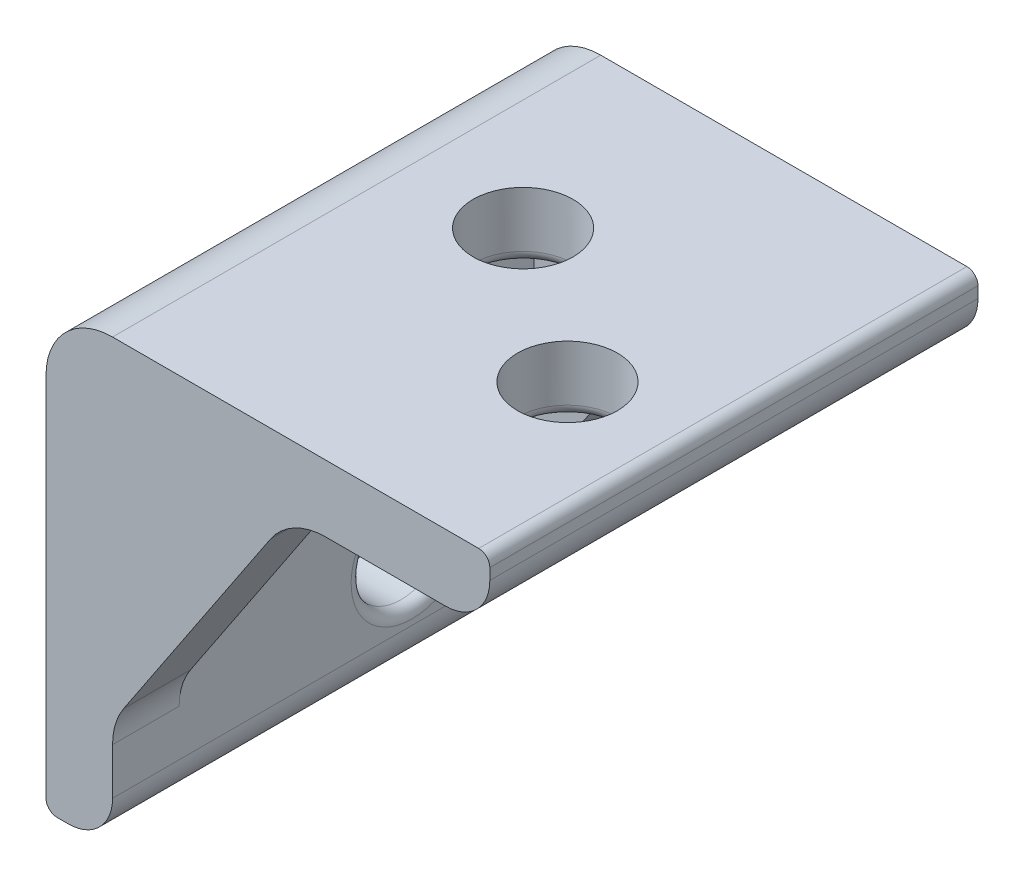
ISO-10303-21;
HEADER;
FILE_DESCRIPTION(('STEP AP214'),'2;1');
FILE_NAME('part.step','',(''),(''),'','','');
FILE_SCHEMA(('AUTOMOTIVE_DESIGN { 1 0 10303 214 1 1 1 1 }'));
ENDSEC;
DATA;
#1=APPLICATION_CONTEXT('core data for automotive mechanical design processes');
#2=APPLICATION_PROTOCOL_DEFINITION('international standard','automotive_design',2000,#1);
#3=PRODUCT_CONTEXT('',#1,'mechanical');
#4=PRODUCT('Part','Part','',(#3));
#5=PRODUCT_RELATED_PRODUCT_CATEGORY('part','',(#4));
#6=PRODUCT_DEFINITION_FORMATION('','',#4);
#7=PRODUCT_DEFINITION_CONTEXT('part definition',#1,'design');
#8=PRODUCT_DEFINITION('design','',#6,#7);
#9=PRODUCT_DEFINITION_SHAPE('','',#8);
#10=(LENGTH_UNIT() NAMED_UNIT(*) SI_UNIT(.MILLI.,.METRE.));
#11=(NAMED_UNIT(*) PLANE_ANGLE_UNIT() SI_UNIT($,.RADIAN.));
#12=(NAMED_UNIT(*) SI_UNIT($,.STERADIAN.) SOLID_ANGLE_UNIT());
#13=UNCERTAINTY_MEASURE_WITH_UNIT(LENGTH_MEASURE(1.E-05),#10,'distance_accuracy_value','');
#14=(GEOMETRIC_REPRESENTATION_CONTEXT(3) GLOBAL_UNCERTAINTY_ASSIGNED_CONTEXT((#13)) GLOBAL_UNIT_ASSIGNED_CONTEXT((#10,
#11,#12)) REPRESENTATION_CONTEXT('',''));
#15=CARTESIAN_POINT('',(0.,0.,0.));
#16=DIRECTION('',(0.,0.,1.));
#17=DIRECTION('',(1.,0.,0.));
#18=AXIS2_PLACEMENT_3D('',#15,#16,#17);
#19=CARTESIAN_POINT('',(-19.5,-16.5,11.));
#20=DIRECTION('',(0.,0.,-1.));
#21=DIRECTION('',(-1.,0.,0.));
#22=AXIS2_PLACEMENT_3D('',#19,#20,#21);
#23=CYLINDRICAL_SURFACE('',#22,0.500000000000002);
#24=CARTESIAN_POINT('',(-19.5,-16.5,-11.));
#25=DIRECTION('',(0.,0.,1.));
#26=DIRECTION('',(1.,0.,0.));
#27=AXIS2_PLACEMENT_3D('',#24,#25,#26);
#28=CIRCLE('',#27,0.500000000000002);
#29=CARTESIAN_POINT('',(-20.,-16.5,-11.));
#30=VERTEX_POINT('',#29);
#31=CARTESIAN_POINT('',(-19.5,-17.,-11.));
#32=VERTEX_POINT('',#31);
#33=EDGE_CURVE('E219',#30,#32,#28,.T.);
#34=ORIENTED_EDGE('',*,*,#33,.T.);
#35=DIRECTION('',(0.,0.,-1.));
#36=VECTOR('',#35,1.);
#37=CARTESIAN_POINT('',(-19.5,-17.,11.));
#38=LINE('',#37,#36);
#39=CARTESIAN_POINT('',(-19.5,-17.,11.));
#40=VERTEX_POINT('',#39);
#41=EDGE_CURVE('E208',#40,#32,#38,.T.);
#42=ORIENTED_EDGE('',*,*,#41,.F.);
#43=CARTESIAN_POINT('',(-19.5,-16.5,11.));
#44=DIRECTION('',(0.,0.,1.));
#45=DIRECTION('',(1.,0.,0.));
#46=AXIS2_PLACEMENT_3D('',#43,#44,#45);
#47=CIRCLE('',#46,0.500000000000002);
#48=CARTESIAN_POINT('',(-20.,-16.5,11.));
#49=VERTEX_POINT('',#48);
#50=EDGE_CURVE('E317',#49,#40,#47,.T.);
#51=ORIENTED_EDGE('',*,*,#50,.F.);
#52=DIRECTION('',(0.,0.,-1.));
#53=VECTOR('',#52,1.);
#54=CARTESIAN_POINT('',(-20.,-16.5,11.));
#55=LINE('',#54,#53);
#56=EDGE_CURVE('E318',#49,#30,#55,.T.);
#57=ORIENTED_EDGE('',*,*,#56,.T.);
#58=EDGE_LOOP('',(#34,#42,#51,#57));
#59=FACE_BOUND('',#58,.T.);
#60=ADVANCED_FACE('F38',(#59),#23,.T.);
#61=CARTESIAN_POINT('',(-19.,-17.,11.));
#62=DIRECTION('',(0.,1.,0.));
#63=DIRECTION('',(-1.,0.,0.));
#64=AXIS2_PLACEMENT_3D('',#61,#62,#63);
#65=PLANE('',#64);
#66=DIRECTION('',(1.,0.,0.));
#67=VECTOR('',#66,1.);
#68=CARTESIAN_POINT('',(-19.,-17.,-11.));
#69=LINE('',#68,#67);
#70=CARTESIAN_POINT('',(-19.,-17.,-11.));
#71=VERTEX_POINT('',#70);
#72=EDGE_CURVE('E359',#32,#71,#69,.T.);
#73=ORIENTED_EDGE('',*,*,#72,.T.);
#74=DIRECTION('',(0.,0.,-1.));
#75=VECTOR('',#74,1.);
#76=CARTESIAN_POINT('',(-19.,-17.,11.));
#77=LINE('',#76,#75);
#78=CARTESIAN_POINT('',(-19.,-17.,11.));
#79=VERTEX_POINT('',#78);
#80=EDGE_CURVE('E199',#79,#71,#77,.T.);
#81=ORIENTED_EDGE('',*,*,#80,.F.);
#82=DIRECTION('',(1.,0.,0.));
#83=VECTOR('',#82,1.);
#84=CARTESIAN_POINT('',(-19.,-17.,11.));
#85=LINE('',#84,#83);
#86=EDGE_CURVE('E382',#40,#79,#85,.T.);
#87=ORIENTED_EDGE('',*,*,#86,.F.);
#88=ORIENTED_EDGE('',*,*,#41,.T.);
#89=EDGE_LOOP('',(#73,#81,#87,#88));
#90=FACE_BOUND('',#89,.T.);
#91=ADVANCED_FACE('F410',(#90),#65,.F.);
#92=CARTESIAN_POINT('',(-19.,-15.,11.));
#93=DIRECTION('',(0.,0.,-1.));
#94=DIRECTION('',(-1.,0.,0.));
#95=AXIS2_PLACEMENT_3D('',#92,#93,#94);
#96=CYLINDRICAL_SURFACE('',#95,2.);
#97=CARTESIAN_POINT('',(-19.,-15.,-11.));
#98=DIRECTION('',(0.,0.,1.));
#99=DIRECTION('',(-1.,0.,0.));
#100=AXIS2_PLACEMENT_3D('',#97,#98,#99);
#101=CIRCLE('',#100,2.);
#102=CARTESIAN_POINT('',(-17.,-15.,-11.));
#103=VERTEX_POINT('',#102);
#104=EDGE_CURVE('E305',#71,#103,#101,.T.);
#105=ORIENTED_EDGE('',*,*,#104,.T.);
#106=DIRECTION('',(0.,0.,-1.));
#107=VECTOR('',#106,1.);
#108=CARTESIAN_POINT('',(-17.,-15.,11.));
#109=LINE('',#108,#107);
#110=CARTESIAN_POINT('',(-17.,-15.,11.));
#111=VERTEX_POINT('',#110);
#112=EDGE_CURVE('E195',#111,#103,#109,.T.);
#113=ORIENTED_EDGE('',*,*,#112,.F.);
#114=CARTESIAN_POINT('',(-19.,-15.,11.));
#115=DIRECTION('',(0.,0.,1.));
#116=DIRECTION('',(-1.,0.,0.));
#117=AXIS2_PLACEMENT_3D('',#114,#115,#116);
#118=CIRCLE('',#117,2.);
#119=EDGE_CURVE('E384',#79,#111,#118,.T.);
#120=ORIENTED_EDGE('',*,*,#119,.F.);
#121=ORIENTED_EDGE('',*,*,#80,.T.);
#122=EDGE_LOOP('',(#105,#113,#120,#121));
#123=FACE_BOUND('',#122,.T.);
#124=ADVANCED_FACE('F363',(#123),#96,.T.);
#125=CARTESIAN_POINT('',(-17.,0.,11.));
#126=DIRECTION('',(-1.,0.,0.));
#127=DIRECTION('',(0.,-1.,0.));
#128=AXIS2_PLACEMENT_3D('',#125,#126,#127);
#129=PLANE('',#128);
#130=CARTESIAN_POINT('',(-17.,-5.,2.5));
#131=DIRECTION('',(-1.,0.,0.));
#132=DIRECTION('',(0.,-1.,0.));
#133=AXIS2_PLACEMENT_3D('',#130,#131,#132);
#134=CIRCLE('',#133,2.75);
#135=CARTESIAN_POINT('',(-17.,-7.75,2.5));
#136=VERTEX_POINT('',#135);
#137=EDGE_CURVE('E239',#136,#136,#134,.T.);
#138=ORIENTED_EDGE('',*,*,#137,.T.);
#139=EDGE_LOOP('',(#138));
#140=FACE_BOUND('',#139,.T.);
#141=CARTESIAN_POINT('',(-17.,-12.,-2.5));
#142=DIRECTION('',(-1.,0.,0.));
#143=DIRECTION('',(0.,-1.,0.));
#144=AXIS2_PLACEMENT_3D('',#141,#142,#143);
#145=CIRCLE('',#144,2.75);
#146=CARTESIAN_POINT('',(-17.,-14.75,-2.5));
#147=VERTEX_POINT('',#146);
#148=EDGE_CURVE('E236',#147,#147,#145,.T.);
#149=ORIENTED_EDGE('',*,*,#148,.T.);
#150=EDGE_LOOP('',(#149));
#151=FACE_BOUND('',#150,.T.);
#152=DIRECTION('',(0.,-1.,0.));
#153=VECTOR('',#152,1.);
#154=CARTESIAN_POINT('',(-17.,0.,8.));
#155=LINE('',#154,#153);
#156=CARTESIAN_POINT('',(-17.,0.,8.));
#157=VERTEX_POINT('',#156);
#158=CARTESIAN_POINT('',(-17.,-12.908326913196,8.));
#159=VERTEX_POINT('',#158);
#160=EDGE_CURVE('E167',#157,#159,#155,.T.);
#161=ORIENTED_EDGE('',*,*,#160,.T.);
#162=DIRECTION('',(0.,0.,1.));
#163=VECTOR('',#162,1.);
#164=CARTESIAN_POINT('',(-17.,-12.908326913196,11.));
#165=LINE('',#164,#163);
#166=CARTESIAN_POINT('',(-17.,-12.908326913196,11.));
#167=VERTEX_POINT('',#166);
#168=EDGE_CURVE('E259',#159,#167,#165,.T.);
#169=ORIENTED_EDGE('',*,*,#168,.T.);
#170=DIRECTION('',(0.,1.,0.));
#171=VECTOR('',#170,1.);
#172=CARTESIAN_POINT('',(-17.,0.,11.));
#173=LINE('',#172,#171);
#174=EDGE_CURVE('E370',#111,#167,#173,.T.);
#175=ORIENTED_EDGE('',*,*,#174,.F.);
#176=ORIENTED_EDGE('',*,*,#112,.T.);
#177=DIRECTION('',(0.,1.,0.));
#178=VECTOR('',#177,1.);
#179=CARTESIAN_POINT('',(-17.,0.,-11.));
#180=LINE('',#179,#178);
#181=CARTESIAN_POINT('',(-17.,-12.908326913196,-11.));
#182=VERTEX_POINT('',#181);
#183=EDGE_CURVE('E300',#103,#182,#180,.T.);
#184=ORIENTED_EDGE('',*,*,#183,.T.);
#185=DIRECTION('',(0.,0.,-1.));
#186=VECTOR('',#185,1.);
#187=CARTESIAN_POINT('',(-17.,-12.908326913196,11.));
#188=LINE('',#187,#186);
#189=CARTESIAN_POINT('',(-17.,-12.908326913196,-8.));
#190=VERTEX_POINT('',#189);
#191=EDGE_CURVE('E257',#182,#190,#188,.F.);
#192=ORIENTED_EDGE('',*,*,#191,.T.);
#193=DIRECTION('',(0.,1.,0.));
#194=VECTOR('',#193,1.);
#195=CARTESIAN_POINT('',(-17.,0.,-8.));
#196=LINE('',#195,#194);
#197=CARTESIAN_POINT('',(-17.,0.,-8.));
#198=VERTEX_POINT('',#197);
#199=EDGE_CURVE('E193',#190,#198,#196,.T.);
#200=ORIENTED_EDGE('',*,*,#199,.T.);
#201=DIRECTION('',(0.,0.,-1.));
#202=VECTOR('',#201,1.);
#203=CARTESIAN_POINT('',(-17.,0.,11.));
#204=LINE('',#203,#202);
#205=EDGE_CURVE('E185',#157,#198,#204,.T.);
#206=ORIENTED_EDGE('',*,*,#205,.F.);
#207=EDGE_LOOP('',(#161,#169,#175,#176,#184,#192,#200,#206));
#208=FACE_BOUND('',#207,.T.);
#209=ADVANCED_FACE('F191',(#140,#151,#208),#129,.F.);
#210=CARTESIAN_POINT('',(-17.,0.,11.));
#211=DIRECTION('',(0.,1.,0.));
#212=DIRECTION('',(-1.,0.,0.));
#213=AXIS2_PLACEMENT_3D('',#210,#211,#212);
#214=PLANE('',#213);
#215=CARTESIAN_POINT('',(-12.,0.,-2.5));
#216=DIRECTION('',(0.,1.,0.));
#217=DIRECTION('',(-1.,0.,0.));
#218=AXIS2_PLACEMENT_3D('',#215,#216,#217);
#219=CIRCLE('',#218,2.75);
#220=CARTESIAN_POINT('',(-14.75,0.,-2.5));
#221=VERTEX_POINT('',#220);
#222=EDGE_CURVE('E227',#221,#221,#219,.T.);
#223=ORIENTED_EDGE('',*,*,#222,.T.);
#224=EDGE_LOOP('',(#223));
#225=FACE_BOUND('',#224,.T.);
#226=CARTESIAN_POINT('',(-5.,0.,2.5));
#227=DIRECTION('',(0.,1.,0.));
#228=DIRECTION('',(-1.,0.,0.));
#229=AXIS2_PLACEMENT_3D('',#226,#227,#228);
#230=CIRCLE('',#229,2.75);
#231=CARTESIAN_POINT('',(-7.75,0.,2.5));
#232=VERTEX_POINT('',#231);
#233=EDGE_CURVE('E211',#232,#232,#230,.T.);
#234=ORIENTED_EDGE('',*,*,#233,.T.);
#235=EDGE_LOOP('',(#234));
#236=FACE_BOUND('',#235,.T.);
#237=DIRECTION('',(1.,0.,0.));
#238=VECTOR('',#237,1.);
#239=CARTESIAN_POINT('',(-17.,0.,11.));
#240=LINE('',#239,#238);
#241=CARTESIAN_POINT('',(-7.39444872453601,0.,11.));
#242=VERTEX_POINT('',#241);
#243=CARTESIAN_POINT('',(-2.00000000000001,0.,11.));
#244=VERTEX_POINT('',#243);
#245=EDGE_CURVE('E387',#242,#244,#240,.T.);
#246=ORIENTED_EDGE('',*,*,#245,.F.);
#247=DIRECTION('',(0.,0.,-1.));
#248=VECTOR('',#247,1.);
#249=CARTESIAN_POINT('',(-7.39444872453601,0.,11.));
#250=LINE('',#249,#248);
#251=CARTESIAN_POINT('',(-7.39444872453601,0.,8.));
#252=VERTEX_POINT('',#251);
#253=EDGE_CURVE('E188',#242,#252,#250,.T.);
#254=ORIENTED_EDGE('',*,*,#253,.T.);
#255=DIRECTION('',(-1.,0.,0.));
#256=VECTOR('',#255,1.);
#257=CARTESIAN_POINT('',(-17.,0.,8.));
#258=LINE('',#257,#256);
#259=EDGE_CURVE('E170',#252,#157,#258,.T.);
#260=ORIENTED_EDGE('',*,*,#259,.T.);
#261=ORIENTED_EDGE('',*,*,#205,.T.);
#262=DIRECTION('',(1.,0.,0.));
#263=VECTOR('',#262,1.);
#264=CARTESIAN_POINT('',(-17.,0.,-8.));
#265=LINE('',#264,#263);
#266=CARTESIAN_POINT('',(-7.39444872453601,0.,-8.));
#267=VERTEX_POINT('',#266);
#268=EDGE_CURVE('E286',#198,#267,#265,.T.);
#269=ORIENTED_EDGE('',*,*,#268,.T.);
#270=DIRECTION('',(0.,0.,1.));
#271=VECTOR('',#270,1.);
#272=CARTESIAN_POINT('',(-7.39444872453601,0.,11.));
#273=LINE('',#272,#271);
#274=CARTESIAN_POINT('',(-7.39444872453601,0.,-11.));
#275=VERTEX_POINT('',#274);
#276=EDGE_CURVE('E265',#267,#275,#273,.F.);
#277=ORIENTED_EDGE('',*,*,#276,.T.);
#278=DIRECTION('',(1.,0.,0.));
#279=VECTOR('',#278,1.);
#280=CARTESIAN_POINT('',(-17.,0.,-11.));
#281=LINE('',#280,#279);
#282=CARTESIAN_POINT('',(-2.00000000000001,0.,-11.));
#283=VERTEX_POINT('',#282);
#284=EDGE_CURVE('E292',#275,#283,#281,.T.);
#285=ORIENTED_EDGE('',*,*,#284,.T.);
#286=DIRECTION('',(0.,0.,-1.));
#287=VECTOR('',#286,1.);
#288=CARTESIAN_POINT('',(-2.00000000000001,0.,11.));
#289=LINE('',#288,#287);
#290=EDGE_CURVE('E196',#244,#283,#289,.T.);
#291=ORIENTED_EDGE('',*,*,#290,.F.);
#292=EDGE_LOOP('',(#246,#254,#260,#261,#269,#277,#285,#291));
#293=FACE_BOUND('',#292,.T.);
#294=ADVANCED_FACE('F184',(#225,#236,#293),#214,.F.);
#295=CARTESIAN_POINT('',(-2.,2.,11.));
#296=DIRECTION('',(0.,0.,-1.));
#297=DIRECTION('',(-1.,0.,0.));
#298=AXIS2_PLACEMENT_3D('',#295,#296,#297);
#299=CYLINDRICAL_SURFACE('',#298,2.);
#300=CARTESIAN_POINT('',(-2.,2.,-11.));
#301=DIRECTION('',(0.,0.,1.));
#302=DIRECTION('',(-1.,0.,0.));
#303=AXIS2_PLACEMENT_3D('',#300,#301,#302);
#304=CIRCLE('',#303,2.);
#305=CARTESIAN_POINT('',(0.,2.00000000000001,-11.));
#306=VERTEX_POINT('',#305);
#307=EDGE_CURVE('E299',#283,#306,#304,.T.);
#308=ORIENTED_EDGE('',*,*,#307,.T.);
#309=DIRECTION('',(0.,0.,-1.));
#310=VECTOR('',#309,1.);
#311=CARTESIAN_POINT('',(0.,2.00000000000001,11.));
#312=LINE('',#311,#310);
#313=CARTESIAN_POINT('',(0.,2.00000000000001,11.));
#314=VERTEX_POINT('',#313);
#315=EDGE_CURVE('E202',#314,#306,#312,.T.);
#316=ORIENTED_EDGE('',*,*,#315,.F.);
#317=CARTESIAN_POINT('',(-2.,2.,11.));
#318=DIRECTION('',(0.,0.,1.));
#319=DIRECTION('',(-1.,0.,0.));
#320=AXIS2_PLACEMENT_3D('',#317,#318,#319);
#321=CIRCLE('',#320,2.);
#322=EDGE_CURVE('E389',#244,#314,#321,.T.);
#323=ORIENTED_EDGE('',*,*,#322,.F.);
#324=ORIENTED_EDGE('',*,*,#290,.T.);
#325=EDGE_LOOP('',(#308,#316,#323,#324));
#326=FACE_BOUND('',#325,.T.);
#327=ADVANCED_FACE('F391',(#326),#299,.T.);
#328=CARTESIAN_POINT('',(0.,2.49999999999999,11.));
#329=DIRECTION('',(-1.,0.,0.));
#330=DIRECTION('',(0.,0.,1.));
#331=AXIS2_PLACEMENT_3D('',#328,#329,#330);
#332=PLANE('',#331);
#333=DIRECTION('',(0.,1.,0.));
#334=VECTOR('',#333,1.);
#335=CARTESIAN_POINT('',(0.,2.49999999999999,-11.));
#336=LINE('',#335,#334);
#337=CARTESIAN_POINT('',(0.,2.49999999999999,-11.));
#338=VERTEX_POINT('',#337);
#339=EDGE_CURVE('E302',#306,#338,#336,.T.);
#340=ORIENTED_EDGE('',*,*,#339,.T.);
#341=DIRECTION('',(0.,0.,-1.));
#342=VECTOR('',#341,1.);
#343=CARTESIAN_POINT('',(0.,2.49999999999999,11.));
#344=LINE('',#343,#342);
#345=CARTESIAN_POINT('',(0.,2.49999999999999,11.));
#346=VERTEX_POINT('',#345);
#347=EDGE_CURVE('E325',#346,#338,#344,.T.);
#348=ORIENTED_EDGE('',*,*,#347,.F.);
#349=DIRECTION('',(0.,1.,0.));
#350=VECTOR('',#349,1.);
#351=CARTESIAN_POINT('',(0.,2.49999999999999,11.));
#352=LINE('',#351,#350);
#353=EDGE_CURVE('E333',#314,#346,#352,.T.);
#354=ORIENTED_EDGE('',*,*,#353,.F.);
#355=ORIENTED_EDGE('',*,*,#315,.T.);
#356=EDGE_LOOP('',(#340,#348,#354,#355));
#357=FACE_BOUND('',#356,.T.);
#358=ADVANCED_FACE('F331',(#357),#332,.F.);
#359=CARTESIAN_POINT('',(-0.5,2.5,11.));
#360=DIRECTION('',(0.,0.,-1.));
#361=DIRECTION('',(-1.,0.,0.));
#362=AXIS2_PLACEMENT_3D('',#359,#360,#361);
#363=CYLINDRICAL_SURFACE('',#362,0.5);
#364=CARTESIAN_POINT('',(-0.5,2.5,-11.));
#365=DIRECTION('',(0.,0.,1.));
#366=DIRECTION('',(1.,0.,0.));
#367=AXIS2_PLACEMENT_3D('',#364,#365,#366);
#368=CIRCLE('',#367,0.5);
#369=CARTESIAN_POINT('',(-0.500000000000004,3.,-11.));
#370=VERTEX_POINT('',#369);
#371=EDGE_CURVE('E310',#338,#370,#368,.T.);
#372=ORIENTED_EDGE('',*,*,#371,.T.);
#373=DIRECTION('',(0.,0.,-1.));
#374=VECTOR('',#373,1.);
#375=CARTESIAN_POINT('',(-0.500000000000004,3.,11.));
#376=LINE('',#375,#374);
#377=CARTESIAN_POINT('',(-0.500000000000004,3.,11.));
#378=VERTEX_POINT('',#377);
#379=EDGE_CURVE('E321',#378,#370,#376,.T.);
#380=ORIENTED_EDGE('',*,*,#379,.F.);
#381=CARTESIAN_POINT('',(-0.5,2.5,11.));
#382=DIRECTION('',(0.,0.,1.));
#383=DIRECTION('',(1.,0.,0.));
#384=AXIS2_PLACEMENT_3D('',#381,#382,#383);
#385=CIRCLE('',#384,0.5);
#386=EDGE_CURVE('E351',#346,#378,#385,.T.);
#387=ORIENTED_EDGE('',*,*,#386,.F.);
#388=ORIENTED_EDGE('',*,*,#347,.T.);
#389=EDGE_LOOP('',(#372,#380,#387,#388));
#390=FACE_BOUND('',#389,.T.);
#391=ADVANCED_FACE('F340',(#390),#363,.T.);
#392=CARTESIAN_POINT('',(-20.,3.,11.));
#393=DIRECTION('',(0.,-1.,0.));
#394=DIRECTION('',(1.,0.,0.));
#395=AXIS2_PLACEMENT_3D('',#392,#393,#394);
#396=PLANE('',#395);
#397=DIRECTION('',(-1.,0.,0.));
#398=VECTOR('',#397,1.);
#399=CARTESIAN_POINT('',(-20.,3.,-11.));
#400=LINE('',#399,#398);
#401=CARTESIAN_POINT('',(-17.,3.,-11.));
#402=VERTEX_POINT('',#401);
#403=EDGE_CURVE('E312',#370,#402,#400,.T.);
#404=ORIENTED_EDGE('',*,*,#403,.T.);
#405=DIRECTION('',(0.,0.,-1.));
#406=VECTOR('',#405,1.);
#407=CARTESIAN_POINT('',(-17.,3.,11.));
#408=LINE('',#407,#406);
#409=CARTESIAN_POINT('',(-17.,3.,11.));
#410=VERTEX_POINT('',#409);
#411=EDGE_CURVE('E253',#402,#410,#408,.F.);
#412=ORIENTED_EDGE('',*,*,#411,.T.);
#413=DIRECTION('',(-1.,0.,0.));
#414=VECTOR('',#413,1.);
#415=CARTESIAN_POINT('',(-20.,3.,11.));
#416=LINE('',#415,#414);
#417=EDGE_CURVE('E348',#378,#410,#416,.T.);
#418=ORIENTED_EDGE('',*,*,#417,.F.);
#419=ORIENTED_EDGE('',*,*,#379,.T.);
#420=EDGE_LOOP('',(#404,#412,#418,#419));
#421=FACE_BOUND('',#420,.T.);
#422=CARTESIAN_POINT('',(-5.,3.,2.5));
#423=DIRECTION('',(0.,-1.,0.));
#424=DIRECTION('',(1.,0.,0.));
#425=AXIS2_PLACEMENT_3D('',#422,#423,#424);
#426=CIRCLE('',#425,2.25);
#427=CARTESIAN_POINT('',(-2.75,3.,2.5));
#428=VERTEX_POINT('',#427);
#429=EDGE_CURVE('E215',#428,#428,#426,.F.);
#430=ORIENTED_EDGE('',*,*,#429,.F.);
#431=EDGE_LOOP('',(#430));
#432=FACE_BOUND('',#431,.T.);
#433=CARTESIAN_POINT('',(-12.,3.,-2.5));
#434=DIRECTION('',(0.,-1.,0.));
#435=DIRECTION('',(1.,0.,0.));
#436=AXIS2_PLACEMENT_3D('',#433,#434,#435);
#437=CIRCLE('',#436,2.25);
#438=CARTESIAN_POINT('',(-9.75,3.,-2.5));
#439=VERTEX_POINT('',#438);
#440=EDGE_CURVE('E212',#439,#439,#437,.F.);
#441=ORIENTED_EDGE('',*,*,#440,.F.);
#442=EDGE_LOOP('',(#441));
#443=FACE_BOUND('',#442,.T.);
#444=ADVANCED_FACE('F344',(#421,#432,#443),#396,.F.);
#445=CARTESIAN_POINT('',(-20.,-16.5,11.));
#446=DIRECTION('',(1.,0.,0.));
#447=DIRECTION('',(0.,0.,-1.));
#448=AXIS2_PLACEMENT_3D('',#445,#446,#447);
#449=PLANE('',#448);
#450=CARTESIAN_POINT('',(-20.,-12.,-2.5));
#451=DIRECTION('',(1.,0.,0.));
#452=DIRECTION('',(0.,0.,-1.));
#453=AXIS2_PLACEMENT_3D('',#450,#451,#452);
#454=CIRCLE('',#453,2.25);
#455=CARTESIAN_POINT('',(-20.,-12.,-4.75));
#456=VERTEX_POINT('',#455);
#457=EDGE_CURVE('E216',#456,#456,#454,.T.);
#458=ORIENTED_EDGE('',*,*,#457,.T.);
#459=EDGE_LOOP('',(#458));
#460=FACE_BOUND('',#459,.T.);
#461=CARTESIAN_POINT('',(-20.,-5.,2.5));
#462=DIRECTION('',(1.,0.,0.));
#463=DIRECTION('',(0.,0.,-1.));
#464=AXIS2_PLACEMENT_3D('',#461,#462,#463);
#465=CIRCLE('',#464,2.25);
#466=CARTESIAN_POINT('',(-20.,-5.,0.249999999999998));
#467=VERTEX_POINT('',#466);
#468=EDGE_CURVE('E220',#467,#467,#465,.T.);
#469=ORIENTED_EDGE('',*,*,#468,.T.);
#470=EDGE_LOOP('',(#469));
#471=FACE_BOUND('',#470,.T.);
#472=DIRECTION('',(0.,-1.,0.));
#473=VECTOR('',#472,1.);
#474=CARTESIAN_POINT('',(-20.,-16.5,11.));
#475=LINE('',#474,#473);
#476=CARTESIAN_POINT('',(-20.,0.,11.));
#477=VERTEX_POINT('',#476);
#478=EDGE_CURVE('E322',#477,#49,#475,.T.);
#479=ORIENTED_EDGE('',*,*,#478,.F.);
#480=DIRECTION('',(0.,0.,-1.));
#481=VECTOR('',#480,1.);
#482=CARTESIAN_POINT('',(-20.,0.,11.));
#483=LINE('',#482,#481);
#484=CARTESIAN_POINT('',(-20.,0.,-11.));
#485=VERTEX_POINT('',#484);
#486=EDGE_CURVE('E248',#477,#485,#483,.T.);
#487=ORIENTED_EDGE('',*,*,#486,.T.);
#488=DIRECTION('',(0.,-1.,0.));
#489=VECTOR('',#488,1.);
#490=CARTESIAN_POINT('',(-20.,-16.5,-11.));
#491=LINE('',#490,#489);
#492=EDGE_CURVE('E315',#485,#30,#491,.T.);
#493=ORIENTED_EDGE('',*,*,#492,.T.);
#494=ORIENTED_EDGE('',*,*,#56,.F.);
#495=EDGE_LOOP('',(#479,#487,#493,#494));
#496=FACE_BOUND('',#495,.T.);
#497=ADVANCED_FACE('F416',(#460,#471,#496),#449,.F.);
#498=CARTESIAN_POINT('',(-19.5,-16.5,11.));
#499=DIRECTION('',(0.,0.,1.));
#500=DIRECTION('',(1.,0.,0.));
#501=AXIS2_PLACEMENT_3D('',#498,#499,#500);
#502=PLANE('',#501);
#503=ORIENTED_EDGE('',*,*,#417,.T.);
#504=CARTESIAN_POINT('',(-17.,0.,11.));
#505=DIRECTION('',(0.,0.,1.));
#506=DIRECTION('',(1.,0.,0.));
#507=AXIS2_PLACEMENT_3D('',#504,#505,#506);
#508=CIRCLE('',#507,3.);
#509=EDGE_CURVE('E255',#410,#477,#508,.T.);
#510=ORIENTED_EDGE('',*,*,#509,.T.);
#511=ORIENTED_EDGE('',*,*,#478,.T.);
#512=ORIENTED_EDGE('',*,*,#50,.T.);
#513=ORIENTED_EDGE('',*,*,#86,.T.);
#514=ORIENTED_EDGE('',*,*,#119,.T.);
#515=ORIENTED_EDGE('',*,*,#174,.T.);
#516=CARTESIAN_POINT('',(-14.,-12.908326913196,11.));
#517=DIRECTION('',(0.,0.,1.));
#518=DIRECTION('',(1.,0.,0.));
#519=AXIS2_PLACEMENT_3D('',#516,#517,#518);
#520=CIRCLE('',#519,3.);
#521=CARTESIAN_POINT('',(-16.4961508830135,-11.2442263245203,11.));
#522=VERTEX_POINT('',#521);
#523=EDGE_CURVE('E272',#167,#522,#520,.F.);
#524=ORIENTED_EDGE('',*,*,#523,.T.);
#525=DIRECTION('',(-0.554700196225229,-0.832050294337844,0.));
#526=VECTOR('',#525,1.);
#527=CARTESIAN_POINT('',(-9.,0.,11.));
#528=LINE('',#527,#526);
#529=CARTESIAN_POINT('',(-9.89059960754954,-1.33589941132431,11.));
#530=VERTEX_POINT('',#529);
#531=EDGE_CURVE('E402',#530,#522,#528,.T.);
#532=ORIENTED_EDGE('',*,*,#531,.F.);
#533=CARTESIAN_POINT('',(-7.39444872453601,-3.,11.));
#534=DIRECTION('',(0.,0.,1.));
#535=DIRECTION('',(1.,0.,0.));
#536=AXIS2_PLACEMENT_3D('',#533,#534,#535);
#537=CIRCLE('',#536,3.);
#538=EDGE_CURVE('E277',#530,#242,#537,.F.);
#539=ORIENTED_EDGE('',*,*,#538,.T.);
#540=ORIENTED_EDGE('',*,*,#245,.T.);
#541=ORIENTED_EDGE('',*,*,#322,.T.);
#542=ORIENTED_EDGE('',*,*,#353,.T.);
#543=ORIENTED_EDGE('',*,*,#386,.T.);
#544=EDGE_LOOP('',(#503,#510,#511,#512,#513,#514,#515,#524,#532,#539,#540,#541,#542,#543));
#545=FACE_BOUND('',#544,.T.);
#546=ADVANCED_FACE('F390',(#545),#502,.T.);
#547=CARTESIAN_POINT('',(-19.5,-16.5,-11.));
#548=DIRECTION('',(0.,0.,1.));
#549=DIRECTION('',(1.,0.,0.));
#550=AXIS2_PLACEMENT_3D('',#547,#548,#549);
#551=PLANE('',#550);
#552=ORIENTED_EDGE('',*,*,#492,.F.);
#553=CARTESIAN_POINT('',(-17.,0.,-11.));
#554=DIRECTION('',(0.,0.,1.));
#555=DIRECTION('',(1.,0.,0.));
#556=AXIS2_PLACEMENT_3D('',#553,#554,#555);
#557=CIRCLE('',#556,3.);
#558=EDGE_CURVE('E251',#485,#402,#557,.F.);
#559=ORIENTED_EDGE('',*,*,#558,.T.);
#560=ORIENTED_EDGE('',*,*,#403,.F.);
#561=ORIENTED_EDGE('',*,*,#371,.F.);
#562=ORIENTED_EDGE('',*,*,#339,.F.);
#563=ORIENTED_EDGE('',*,*,#307,.F.);
#564=ORIENTED_EDGE('',*,*,#284,.F.);
#565=CARTESIAN_POINT('',(-7.39444872453601,-3.,-11.));
#566=DIRECTION('',(0.,0.,1.));
#567=DIRECTION('',(1.,0.,0.));
#568=AXIS2_PLACEMENT_3D('',#565,#566,#567);
#569=CIRCLE('',#568,3.);
#570=CARTESIAN_POINT('',(-9.89059960754954,-1.33589941132431,-11.));
#571=VERTEX_POINT('',#570);
#572=EDGE_CURVE('E279',#275,#571,#569,.T.);
#573=ORIENTED_EDGE('',*,*,#572,.T.);
#574=DIRECTION('',(-0.554700196225229,-0.832050294337844,0.));
#575=VECTOR('',#574,1.);
#576=CARTESIAN_POINT('',(-9.,0.,-11.));
#577=LINE('',#576,#575);
#578=CARTESIAN_POINT('',(-16.4961508830135,-11.2442263245203,-11.));
#579=VERTEX_POINT('',#578);
#580=EDGE_CURVE('E179',#571,#579,#577,.T.);
#581=ORIENTED_EDGE('',*,*,#580,.T.);
#582=CARTESIAN_POINT('',(-14.,-12.908326913196,-11.));
#583=DIRECTION('',(0.,0.,1.));
#584=DIRECTION('',(1.,0.,0.));
#585=AXIS2_PLACEMENT_3D('',#582,#583,#584);
#586=CIRCLE('',#585,3.);
#587=EDGE_CURVE('E12',#579,#182,#586,.T.);
#588=ORIENTED_EDGE('',*,*,#587,.T.);
#589=ORIENTED_EDGE('',*,*,#183,.F.);
#590=ORIENTED_EDGE('',*,*,#104,.F.);
#591=ORIENTED_EDGE('',*,*,#72,.F.);
#592=ORIENTED_EDGE('',*,*,#33,.F.);
#593=EDGE_LOOP('',(#552,#559,#560,#561,#562,#563,#564,#573,#581,#588,#589,#590,#591,#592));
#594=FACE_BOUND('',#593,.T.);
#595=ADVANCED_FACE('F296',(#594),#551,.F.);
#596=CARTESIAN_POINT('',(-12.,10.,-2.5));
#597=DIRECTION('',(0.,-1.,0.));
#598=DIRECTION('',(0.,0.,-1.));
#599=AXIS2_PLACEMENT_3D('',#596,#597,#598);
#600=CYLINDRICAL_SURFACE('',#599,2.25);
#601=CARTESIAN_POINT('',(-12.,0.5,-2.5));
#602=DIRECTION('',(0.,1.,0.));
#603=DIRECTION('',(-1.,0.,0.));
#604=AXIS2_PLACEMENT_3D('',#601,#602,#603);
#605=CIRCLE('',#604,2.25);
#606=CARTESIAN_POINT('',(-14.25,0.5,-2.5));
#607=VERTEX_POINT('',#606);
#608=EDGE_CURVE('E230',#607,#607,#605,.F.);
#609=ORIENTED_EDGE('',*,*,#608,.T.);
#610=EDGE_LOOP('',(#609));
#611=FACE_BOUND('',#610,.T.);
#612=ORIENTED_EDGE('',*,*,#440,.T.);
#613=EDGE_LOOP('',(#612));
#614=FACE_BOUND('',#613,.T.);
#615=ADVANCED_FACE('F478',(#611,#614),#600,.F.);
#616=CARTESIAN_POINT('',(-5.,10.,2.5));
#617=DIRECTION('',(0.,-1.,0.));
#618=DIRECTION('',(0.,0.,-1.));
#619=AXIS2_PLACEMENT_3D('',#616,#617,#618);
#620=CYLINDRICAL_SURFACE('',#619,2.25);
#621=CARTESIAN_POINT('',(-5.,0.5,2.5));
#622=DIRECTION('',(0.,1.,0.));
#623=DIRECTION('',(-1.,0.,0.));
#624=AXIS2_PLACEMENT_3D('',#621,#622,#623);
#625=CIRCLE('',#624,2.25);
#626=CARTESIAN_POINT('',(-7.25,0.5,2.5));
#627=VERTEX_POINT('',#626);
#628=EDGE_CURVE('E242',#627,#627,#625,.F.);
#629=ORIENTED_EDGE('',*,*,#628,.T.);
#630=EDGE_LOOP('',(#629));
#631=FACE_BOUND('',#630,.T.);
#632=ORIENTED_EDGE('',*,*,#429,.T.);
#633=EDGE_LOOP('',(#632));
#634=FACE_BOUND('',#633,.T.);
#635=ADVANCED_FACE('F472',(#631,#634),#620,.F.);
#636=CARTESIAN_POINT('',(-37.,-5.,2.5));
#637=DIRECTION('',(1.,0.,0.));
#638=DIRECTION('',(0.,0.,-1.));
#639=AXIS2_PLACEMENT_3D('',#636,#637,#638);
#640=CYLINDRICAL_SURFACE('',#639,2.25);
#641=CARTESIAN_POINT('',(-17.5,-5.,2.5));
#642=DIRECTION('',(-1.,0.,0.));
#643=DIRECTION('',(0.,-1.,0.));
#644=AXIS2_PLACEMENT_3D('',#641,#642,#643);
#645=CIRCLE('',#644,2.25);
#646=CARTESIAN_POINT('',(-17.5,-7.25,2.5));
#647=VERTEX_POINT('',#646);
#648=EDGE_CURVE('E233',#647,#647,#645,.F.);
#649=ORIENTED_EDGE('',*,*,#648,.T.);
#650=EDGE_LOOP('',(#649));
#651=FACE_BOUND('',#650,.T.);
#652=ORIENTED_EDGE('',*,*,#468,.F.);
#653=EDGE_LOOP('',(#652));
#654=FACE_BOUND('',#653,.T.);
#655=ADVANCED_FACE('F462',(#651,#654),#640,.F.);
#656=CARTESIAN_POINT('',(-37.,-12.,-2.5));
#657=DIRECTION('',(1.,0.,0.));
#658=DIRECTION('',(0.,0.,-1.));
#659=AXIS2_PLACEMENT_3D('',#656,#657,#658);
#660=CYLINDRICAL_SURFACE('',#659,2.25);
#661=CARTESIAN_POINT('',(-17.5,-12.,-2.5));
#662=DIRECTION('',(-1.,0.,0.));
#663=DIRECTION('',(0.,-1.,0.));
#664=AXIS2_PLACEMENT_3D('',#661,#662,#663);
#665=CIRCLE('',#664,2.25);
#666=CARTESIAN_POINT('',(-17.5,-14.25,-2.5));
#667=VERTEX_POINT('',#666);
#668=EDGE_CURVE('E245',#667,#667,#665,.F.);
#669=ORIENTED_EDGE('',*,*,#668,.T.);
#670=EDGE_LOOP('',(#669));
#671=FACE_BOUND('',#670,.T.);
#672=ORIENTED_EDGE('',*,*,#457,.F.);
#673=EDGE_LOOP('',(#672));
#674=FACE_BOUND('',#673,.T.);
#675=ADVANCED_FACE('F441',(#671,#674),#660,.F.);
#676=CARTESIAN_POINT('',(-12.,0.5,-2.5));
#677=DIRECTION('',(0.,1.,0.));
#678=DIRECTION('',(-1.,0.,0.));
#679=AXIS2_PLACEMENT_3D('',#676,#677,#678);
#680=TOROIDAL_SURFACE('',#679,2.75,0.5);
#681=ORIENTED_EDGE('',*,*,#608,.F.);
#682=EDGE_LOOP('',(#681));
#683=FACE_BOUND('',#682,.T.);
#684=ORIENTED_EDGE('',*,*,#222,.F.);
#685=EDGE_LOOP('',(#684));
#686=FACE_BOUND('',#685,.T.);
#687=ADVANCED_FACE('F437',(#683,#686),#680,.T.);
#688=CARTESIAN_POINT('',(-17.5,-5.,2.5));
#689=DIRECTION('',(-1.,0.,0.));
#690=DIRECTION('',(0.,-1.,0.));
#691=AXIS2_PLACEMENT_3D('',#688,#689,#690);
#692=TOROIDAL_SURFACE('',#691,2.75,0.5);
#693=ORIENTED_EDGE('',*,*,#137,.F.);
#694=EDGE_LOOP('',(#693));
#695=FACE_BOUND('',#694,.T.);
#696=ORIENTED_EDGE('',*,*,#648,.F.);
#697=EDGE_LOOP('',(#696));
#698=FACE_BOUND('',#697,.T.);
#699=ADVANCED_FACE('F440',(#695,#698),#692,.T.);
#700=CARTESIAN_POINT('',(-5.,0.5,2.5));
#701=DIRECTION('',(0.,1.,0.));
#702=DIRECTION('',(-1.,0.,0.));
#703=AXIS2_PLACEMENT_3D('',#700,#701,#702);
#704=TOROIDAL_SURFACE('',#703,2.75,0.5);
#705=ORIENTED_EDGE('',*,*,#628,.F.);
#706=EDGE_LOOP('',(#705));
#707=FACE_BOUND('',#706,.T.);
#708=ORIENTED_EDGE('',*,*,#233,.F.);
#709=EDGE_LOOP('',(#708));
#710=FACE_BOUND('',#709,.T.);
#711=ADVANCED_FACE('F445',(#707,#710),#704,.T.);
#712=CARTESIAN_POINT('',(-17.5,-12.,-2.5));
#713=DIRECTION('',(-1.,0.,0.));
#714=DIRECTION('',(0.,-1.,0.));
#715=AXIS2_PLACEMENT_3D('',#712,#713,#714);
#716=TOROIDAL_SURFACE('',#715,2.75,0.5);
#717=ORIENTED_EDGE('',*,*,#148,.F.);
#718=EDGE_LOOP('',(#717));
#719=FACE_BOUND('',#718,.T.);
#720=ORIENTED_EDGE('',*,*,#668,.F.);
#721=EDGE_LOOP('',(#720));
#722=FACE_BOUND('',#721,.T.);
#723=ADVANCED_FACE('F448',(#719,#722),#716,.T.);
#724=CARTESIAN_POINT('',(-10.,-7.,-8.));
#725=DIRECTION('',(0.,0.,1.));
#726=DIRECTION('',(1.,0.,0.));
#727=AXIS2_PLACEMENT_3D('',#724,#725,#726);
#728=PLANE('',#727);
#729=ORIENTED_EDGE('',*,*,#268,.F.);
#730=ORIENTED_EDGE('',*,*,#199,.F.);
#731=CARTESIAN_POINT('',(-14.,-12.908326913196,-8.));
#732=DIRECTION('',(0.,0.,1.));
#733=DIRECTION('',(1.,0.,0.));
#734=AXIS2_PLACEMENT_3D('',#731,#732,#733);
#735=CIRCLE('',#734,3.);
#736=CARTESIAN_POINT('',(-16.4961508830135,-11.2442263245203,-8.));
#737=VERTEX_POINT('',#736);
#738=EDGE_CURVE('E46',#190,#737,#735,.F.);
#739=ORIENTED_EDGE('',*,*,#738,.T.);
#740=DIRECTION('',(-0.554700196225229,-0.832050294337844,0.));
#741=VECTOR('',#740,1.);
#742=CARTESIAN_POINT('',(-9.,0.,-8.));
#743=LINE('',#742,#741);
#744=CARTESIAN_POINT('',(-9.89059960754954,-1.33589941132431,-8.));
#745=VERTEX_POINT('',#744);
#746=EDGE_CURVE('E287',#745,#737,#743,.T.);
#747=ORIENTED_EDGE('',*,*,#746,.F.);
#748=CARTESIAN_POINT('',(-7.39444872453601,-3.,-8.));
#749=DIRECTION('',(0.,0.,1.));
#750=DIRECTION('',(1.,0.,0.));
#751=AXIS2_PLACEMENT_3D('',#748,#749,#750);
#752=CIRCLE('',#751,3.);
#753=EDGE_CURVE('E281',#745,#267,#752,.F.);
#754=ORIENTED_EDGE('',*,*,#753,.T.);
#755=EDGE_LOOP('',(#729,#730,#739,#747,#754));
#756=FACE_BOUND('',#755,.T.);
#757=ADVANCED_FACE('F285',(#756),#728,.T.);
#758=CARTESIAN_POINT('',(-9.,0.,-11.));
#759=DIRECTION('',(-0.832050294337844,0.554700196225229,0.));
#760=DIRECTION('',(-0.554700196225229,-0.832050294337844,0.));
#761=AXIS2_PLACEMENT_3D('',#758,#759,#760);
#762=PLANE('',#761);
#763=ORIENTED_EDGE('',*,*,#580,.F.);
#764=DIRECTION('',(0.,0.,-1.));
#765=VECTOR('',#764,1.);
#766=CARTESIAN_POINT('',(-9.89059960754954,-1.33589941132431,-11.));
#767=LINE('',#766,#765);
#768=EDGE_CURVE('E59',#571,#745,#767,.F.);
#769=ORIENTED_EDGE('',*,*,#768,.T.);
#770=ORIENTED_EDGE('',*,*,#746,.T.);
#771=DIRECTION('',(0.,0.,1.));
#772=VECTOR('',#771,1.);
#773=CARTESIAN_POINT('',(-16.4961508830135,-11.2442263245203,-11.));
#774=LINE('',#773,#772);
#775=EDGE_CURVE('E269',#737,#579,#774,.F.);
#776=ORIENTED_EDGE('',*,*,#775,.T.);
#777=EDGE_LOOP('',(#763,#769,#770,#776));
#778=FACE_BOUND('',#777,.T.);
#779=ADVANCED_FACE('F374',(#778),#762,.F.);
#780=CARTESIAN_POINT('',(-10.,-7.,8.));
#781=DIRECTION('',(0.,0.,-1.));
#782=DIRECTION('',(-1.,0.,0.));
#783=AXIS2_PLACEMENT_3D('',#780,#781,#782);
#784=PLANE('',#783);
#785=ORIENTED_EDGE('',*,*,#160,.F.);
#786=ORIENTED_EDGE('',*,*,#259,.F.);
#787=CARTESIAN_POINT('',(-7.39444872453601,-3.,8.));
#788=DIRECTION('',(0.,0.,-1.));
#789=DIRECTION('',(-1.,0.,0.));
#790=AXIS2_PLACEMENT_3D('',#787,#788,#789);
#791=CIRCLE('',#790,3.);
#792=CARTESIAN_POINT('',(-9.89059960754954,-1.33589941132431,8.));
#793=VERTEX_POINT('',#792);
#794=EDGE_CURVE('E275',#252,#793,#791,.F.);
#795=ORIENTED_EDGE('',*,*,#794,.T.);
#796=DIRECTION('',(-0.554700196225229,-0.832050294337844,0.));
#797=VECTOR('',#796,1.);
#798=CARTESIAN_POINT('',(-9.,0.,8.));
#799=LINE('',#798,#797);
#800=CARTESIAN_POINT('',(-16.4961508830135,-11.2442263245203,8.));
#801=VERTEX_POINT('',#800);
#802=EDGE_CURVE('E189',#793,#801,#799,.T.);
#803=ORIENTED_EDGE('',*,*,#802,.T.);
#804=CARTESIAN_POINT('',(-14.,-12.908326913196,8.));
#805=DIRECTION('',(0.,0.,-1.));
#806=DIRECTION('',(-1.,0.,0.));
#807=AXIS2_PLACEMENT_3D('',#804,#805,#806);
#808=CIRCLE('',#807,3.);
#809=EDGE_CURVE('E174',#801,#159,#808,.F.);
#810=ORIENTED_EDGE('',*,*,#809,.T.);
#811=EDGE_LOOP('',(#785,#786,#795,#803,#810));
#812=FACE_BOUND('',#811,.T.);
#813=ADVANCED_FACE('F169',(#812),#784,.T.);
#814=CARTESIAN_POINT('',(-9.,0.,11.));
#815=DIRECTION('',(0.832050294337844,-0.554700196225229,0.));
#816=DIRECTION('',(-0.554700196225229,-0.832050294337844,0.));
#817=AXIS2_PLACEMENT_3D('',#814,#815,#816);
#818=PLANE('',#817);
#819=ORIENTED_EDGE('',*,*,#531,.T.);
#820=DIRECTION('',(0.,0.,1.));
#821=VECTOR('',#820,1.);
#822=CARTESIAN_POINT('',(-16.4961508830135,-11.2442263245203,11.));
#823=LINE('',#822,#821);
#824=EDGE_CURVE('E263',#522,#801,#823,.F.);
#825=ORIENTED_EDGE('',*,*,#824,.T.);
#826=ORIENTED_EDGE('',*,*,#802,.F.);
#827=DIRECTION('',(0.,0.,-1.));
#828=VECTOR('',#827,1.);
#829=CARTESIAN_POINT('',(-9.89059960754954,-1.33589941132431,11.));
#830=LINE('',#829,#828);
#831=EDGE_CURVE('E261',#793,#530,#830,.F.);
#832=ORIENTED_EDGE('',*,*,#831,.T.);
#833=EDGE_LOOP('',(#819,#825,#826,#832));
#834=FACE_BOUND('',#833,.T.);
#835=ADVANCED_FACE('F399',(#834),#818,.T.);
#836=CARTESIAN_POINT('',(-17.,0.,11.));
#837=DIRECTION('',(0.,0.,-1.));
#838=DIRECTION('',(-1.,0.,0.));
#839=AXIS2_PLACEMENT_3D('',#836,#837,#838);
#840=CYLINDRICAL_SURFACE('',#839,3.);
#841=ORIENTED_EDGE('',*,*,#509,.F.);
#842=ORIENTED_EDGE('',*,*,#411,.F.);
#843=ORIENTED_EDGE('',*,*,#558,.F.);
#844=ORIENTED_EDGE('',*,*,#486,.F.);
#845=EDGE_LOOP('',(#841,#842,#843,#844));
#846=FACE_BOUND('',#845,.T.);
#847=ADVANCED_FACE('F419',(#846),#840,.T.);
#848=CARTESIAN_POINT('',(-14.,-12.908326913196,11.));
#849=DIRECTION('',(0.,0.,1.));
#850=DIRECTION('',(1.,0.,0.));
#851=AXIS2_PLACEMENT_3D('',#848,#849,#850);
#852=CYLINDRICAL_SURFACE('',#851,3.);
#853=ORIENTED_EDGE('',*,*,#809,.F.);
#854=ORIENTED_EDGE('',*,*,#824,.F.);
#855=ORIENTED_EDGE('',*,*,#523,.F.);
#856=ORIENTED_EDGE('',*,*,#168,.F.);
#857=EDGE_LOOP('',(#853,#854,#855,#856));
#858=FACE_BOUND('',#857,.T.);
#859=ADVANCED_FACE('F406',(#858),#852,.F.);
#860=CARTESIAN_POINT('',(-7.39444872453601,-3.,11.));
#861=DIRECTION('',(0.,0.,-1.));
#862=DIRECTION('',(-1.,0.,0.));
#863=AXIS2_PLACEMENT_3D('',#860,#861,#862);
#864=CYLINDRICAL_SURFACE('',#863,3.);
#865=ORIENTED_EDGE('',*,*,#538,.F.);
#866=ORIENTED_EDGE('',*,*,#831,.F.);
#867=ORIENTED_EDGE('',*,*,#794,.F.);
#868=ORIENTED_EDGE('',*,*,#253,.F.);
#869=EDGE_LOOP('',(#865,#866,#867,#868));
#870=FACE_BOUND('',#869,.T.);
#871=ADVANCED_FACE('F394',(#870),#864,.F.);
#872=CARTESIAN_POINT('',(-7.39444872453601,-3.,11.));
#873=DIRECTION('',(0.,0.,1.));
#874=DIRECTION('',(1.,0.,0.));
#875=AXIS2_PLACEMENT_3D('',#872,#873,#874);
#876=CYLINDRICAL_SURFACE('',#875,3.);
#877=ORIENTED_EDGE('',*,*,#753,.F.);
#878=ORIENTED_EDGE('',*,*,#768,.F.);
#879=ORIENTED_EDGE('',*,*,#572,.F.);
#880=ORIENTED_EDGE('',*,*,#276,.F.);
#881=EDGE_LOOP('',(#877,#878,#879,#880));
#882=FACE_BOUND('',#881,.T.);
#883=ADVANCED_FACE('F289',(#882),#876,.F.);
#884=CARTESIAN_POINT('',(-14.,-12.908326913196,11.));
#885=DIRECTION('',(0.,0.,-1.));
#886=DIRECTION('',(-1.,0.,0.));
#887=AXIS2_PLACEMENT_3D('',#884,#885,#886);
#888=CYLINDRICAL_SURFACE('',#887,3.);
#889=ORIENTED_EDGE('',*,*,#587,.F.);
#890=ORIENTED_EDGE('',*,*,#775,.F.);
#891=ORIENTED_EDGE('',*,*,#738,.F.);
#892=ORIENTED_EDGE('',*,*,#191,.F.);
#893=EDGE_LOOP('',(#889,#890,#891,#892));
#894=FACE_BOUND('',#893,.T.);
#895=ADVANCED_FACE('F40',(#894),#888,.F.);
#896=CLOSED_SHELL('',(#60,#91,#124,#209,#294,#327,#358,#391,#444,#497,#546,#595,#615,#635,#655,
#675,#687,#699,#711,#723,#757,#779,#813,#835,#847,#859,#871,#883,#895));
#897=MANIFOLD_SOLID_BREP('B2',#896);
#898=ADVANCED_BREP_SHAPE_REPRESENTATION('',(#18,#897),#14);
#899=SHAPE_DEFINITION_REPRESENTATION(#9,#898);
ENDSEC;
END-ISO-10303-21;
